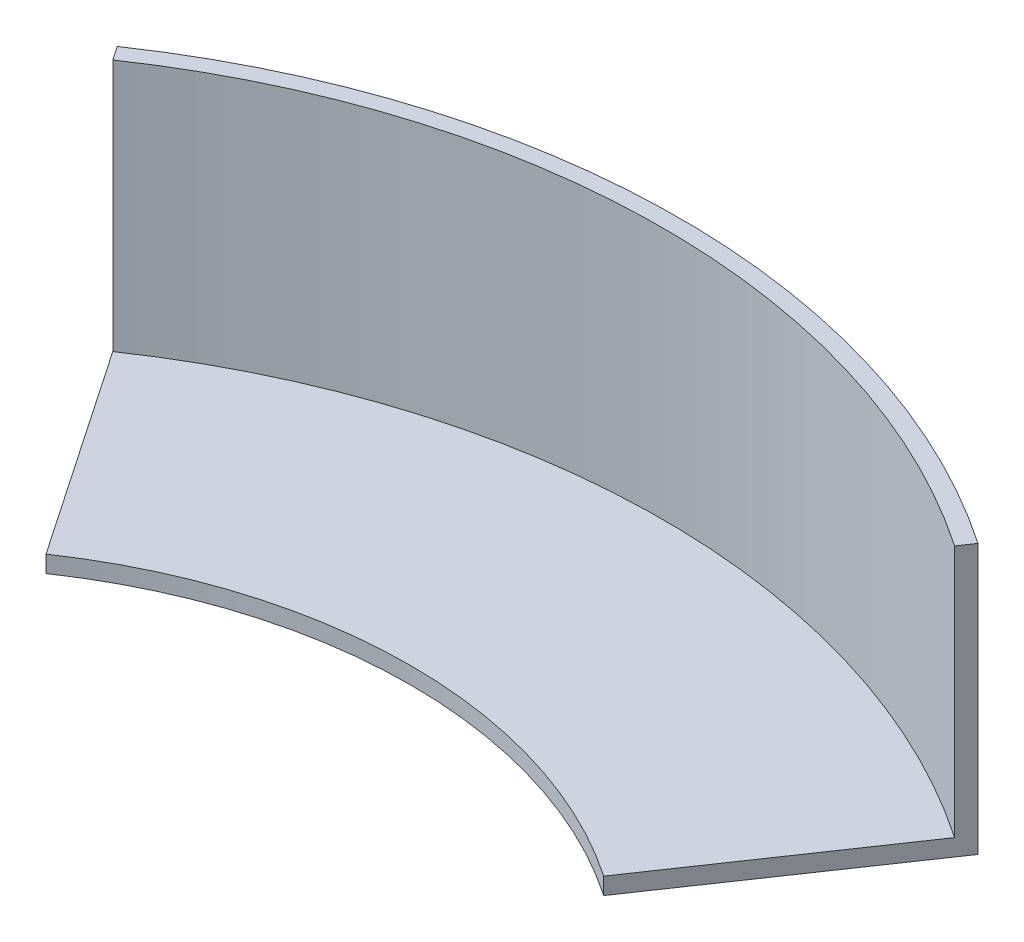
ISO-10303-21;
HEADER;
FILE_DESCRIPTION(('STEP AP214'),'2;1');
FILE_NAME('part.step','',(''),(''),'','','');
FILE_SCHEMA(('AUTOMOTIVE_DESIGN { 1 0 10303 214 1 1 1 1 }'));
ENDSEC;
DATA;
#1=APPLICATION_CONTEXT('core data for automotive mechanical design processes');
#2=APPLICATION_PROTOCOL_DEFINITION('international standard','automotive_design',2000,#1);
#3=PRODUCT_CONTEXT('',#1,'mechanical');
#4=PRODUCT('Part','Part','',(#3));
#5=PRODUCT_RELATED_PRODUCT_CATEGORY('part','',(#4));
#6=PRODUCT_DEFINITION_FORMATION('','',#4);
#7=PRODUCT_DEFINITION_CONTEXT('part definition',#1,'design');
#8=PRODUCT_DEFINITION('design','',#6,#7);
#9=PRODUCT_DEFINITION_SHAPE('','',#8);
#10=(LENGTH_UNIT() NAMED_UNIT(*) SI_UNIT(.MILLI.,.METRE.));
#11=(NAMED_UNIT(*) PLANE_ANGLE_UNIT() SI_UNIT($,.RADIAN.));
#12=(NAMED_UNIT(*) SI_UNIT($,.STERADIAN.) SOLID_ANGLE_UNIT());
#13=UNCERTAINTY_MEASURE_WITH_UNIT(LENGTH_MEASURE(1.E-05),#10,'distance_accuracy_value','');
#14=(GEOMETRIC_REPRESENTATION_CONTEXT(3) GLOBAL_UNCERTAINTY_ASSIGNED_CONTEXT((#13)) GLOBAL_UNIT_ASSIGNED_CONTEXT((#10,
#11,#12)) REPRESENTATION_CONTEXT('',''));
#15=CARTESIAN_POINT('',(0.,0.,0.));
#16=DIRECTION('',(0.,0.,1.));
#17=DIRECTION('',(1.,0.,0.));
#18=AXIS2_PLACEMENT_3D('',#15,#16,#17);
#19=CARTESIAN_POINT('',(0.,15.,0.));
#20=DIRECTION('',(0.,-1.,0.));
#21=DIRECTION('',(0.,0.,-1.));
#22=AXIS2_PLACEMENT_3D('',#19,#20,#21);
#23=CYLINDRICAL_SURFACE('',#22,29.45);
#24=DIRECTION('',(0.,-1.,0.));
#25=VECTOR('',#24,1.);
#26=CARTESIAN_POINT('',(16.5635545556805,15.,-24.3505885037918));
#27=LINE('',#26,#25);
#28=CARTESIAN_POINT('',(16.5635545556805,0.,-24.3505885037918));
#29=VERTEX_POINT('',#28);
#30=CARTESIAN_POINT('',(16.5635545556805,-1.,-24.3505885037918));
#31=VERTEX_POINT('',#30);
#32=EDGE_CURVE('E11',#29,#31,#27,.T.);
#33=ORIENTED_EDGE('',*,*,#32,.F.);
#34=CARTESIAN_POINT('',(0.,0.,0.));
#35=DIRECTION('',(0.,1.,0.));
#36=DIRECTION('',(0.,0.,1.));
#37=AXIS2_PLACEMENT_3D('',#34,#35,#36);
#38=CIRCLE('',#37,29.45);
#39=CARTESIAN_POINT('',(-16.5635545556805,0.,-24.3505885037918));
#40=VERTEX_POINT('',#39);
#41=EDGE_CURVE('E135',#29,#40,#38,.T.);
#42=ORIENTED_EDGE('',*,*,#41,.T.);
#43=DIRECTION('',(0.,-1.,0.));
#44=VECTOR('',#43,1.);
#45=CARTESIAN_POINT('',(-16.5635545556805,15.,-24.3505885037918));
#46=LINE('',#45,#44);
#47=CARTESIAN_POINT('',(-16.5635545556805,-1.,-24.3505885037918));
#48=VERTEX_POINT('',#47);
#49=EDGE_CURVE('E104',#40,#48,#46,.T.);
#50=ORIENTED_EDGE('',*,*,#49,.T.);
#51=CARTESIAN_POINT('',(0.,-1.,0.));
#52=DIRECTION('',(0.,1.,0.));
#53=DIRECTION('',(0.,0.,1.));
#54=AXIS2_PLACEMENT_3D('',#51,#52,#53);
#55=CIRCLE('',#54,29.45);
#56=EDGE_CURVE('E119',#31,#48,#55,.T.);
#57=ORIENTED_EDGE('',*,*,#56,.F.);
#58=EDGE_LOOP('',(#33,#42,#50,#57));
#59=FACE_BOUND('',#58,.T.);
#60=ADVANCED_FACE('F35',(#59),#23,.F.);
#61=CARTESIAN_POINT('',(0.,15.,0.));
#62=DIRECTION('',(-0.826845110485288,0.,-0.562429696287964));
#63=DIRECTION('',(-0.562429696287964,0.,0.826845110485289));
#64=AXIS2_PLACEMENT_3D('',#61,#62,#63);
#65=PLANE('',#64);
#66=DIRECTION('',(0.562429696287964,0.,-0.826845110485288));
#67=VECTOR('',#66,1.);
#68=CARTESIAN_POINT('',(0.,0.,0.));
#69=LINE('',#68,#67);
#70=CARTESIAN_POINT('',(25.,0.,-36.7532651610711));
#71=VERTEX_POINT('',#70);
#72=EDGE_CURVE('E138',#29,#71,#69,.T.);
#73=ORIENTED_EDGE('',*,*,#72,.F.);
#74=ORIENTED_EDGE('',*,*,#32,.T.);
#75=DIRECTION('',(0.562429696287964,0.,-0.826845110485289));
#76=VECTOR('',#75,1.);
#77=CARTESIAN_POINT('',(0.,-1.,0.));
#78=LINE('',#77,#76);
#79=CARTESIAN_POINT('',(25.562429696288,-1.,-37.5801102715564));
#80=VERTEX_POINT('',#79);
#81=EDGE_CURVE('E115',#31,#80,#78,.T.);
#82=ORIENTED_EDGE('',*,*,#81,.T.);
#83=DIRECTION('',(0.,-1.,0.));
#84=VECTOR('',#83,1.);
#85=CARTESIAN_POINT('',(25.562429696288,15.,-37.5801102715564));
#86=LINE('',#85,#84);
#87=CARTESIAN_POINT('',(25.562429696288,15.,-37.5801102715564));
#88=VERTEX_POINT('',#87);
#89=EDGE_CURVE('E44',#88,#80,#86,.T.);
#90=ORIENTED_EDGE('',*,*,#89,.F.);
#91=DIRECTION('',(0.562429696287964,0.,-0.826845110485288));
#92=VECTOR('',#91,1.);
#93=CARTESIAN_POINT('',(0.,15.,0.));
#94=LINE('',#93,#92);
#95=CARTESIAN_POINT('',(25.,15.,-36.7532651610711));
#96=VERTEX_POINT('',#95);
#97=EDGE_CURVE('E108',#96,#88,#94,.T.);
#98=ORIENTED_EDGE('',*,*,#97,.F.);
#99=DIRECTION('',(0.,-1.,0.));
#100=VECTOR('',#99,1.);
#101=CARTESIAN_POINT('',(25.,15.,-36.7532651610711));
#102=LINE('',#101,#100);
#103=EDGE_CURVE('E52',#96,#71,#102,.T.);
#104=ORIENTED_EDGE('',*,*,#103,.T.);
#105=EDGE_LOOP('',(#73,#74,#82,#90,#98,#104));
#106=FACE_BOUND('',#105,.T.);
#107=ADVANCED_FACE('F144',(#106),#65,.F.);
#108=CARTESIAN_POINT('',(0.,15.,0.));
#109=DIRECTION('',(0.826845110485288,0.,-0.562429696287964));
#110=DIRECTION('',(-0.562429696287964,0.,-0.826845110485288));
#111=AXIS2_PLACEMENT_3D('',#108,#109,#110);
#112=PLANE('',#111);
#113=DIRECTION('',(0.562429696287964,0.,0.826845110485288));
#114=VECTOR('',#113,1.);
#115=CARTESIAN_POINT('',(0.,0.,0.));
#116=LINE('',#115,#114);
#117=CARTESIAN_POINT('',(-25.,0.,-36.7532651610711));
#118=VERTEX_POINT('',#117);
#119=EDGE_CURVE('E94',#118,#40,#116,.T.);
#120=ORIENTED_EDGE('',*,*,#119,.F.);
#121=DIRECTION('',(0.,-1.,0.));
#122=VECTOR('',#121,1.);
#123=CARTESIAN_POINT('',(-25.,15.,-36.7532651610711));
#124=LINE('',#123,#122);
#125=CARTESIAN_POINT('',(-25.,15.,-36.7532651610711));
#126=VERTEX_POINT('',#125);
#127=EDGE_CURVE('E91',#126,#118,#124,.T.);
#128=ORIENTED_EDGE('',*,*,#127,.F.);
#129=DIRECTION('',(0.562429696287964,0.,0.826845110485288));
#130=VECTOR('',#129,1.);
#131=CARTESIAN_POINT('',(0.,15.,0.));
#132=LINE('',#131,#130);
#133=CARTESIAN_POINT('',(-25.562429696288,15.,-37.5801102715564));
#134=VERTEX_POINT('',#133);
#135=EDGE_CURVE('E100',#134,#126,#132,.T.);
#136=ORIENTED_EDGE('',*,*,#135,.F.);
#137=DIRECTION('',(0.,-1.,0.));
#138=VECTOR('',#137,1.);
#139=CARTESIAN_POINT('',(-25.562429696288,15.,-37.5801102715564));
#140=LINE('',#139,#138);
#141=CARTESIAN_POINT('',(-25.562429696288,-1.,-37.5801102715564));
#142=VERTEX_POINT('',#141);
#143=EDGE_CURVE('E106',#134,#142,#140,.T.);
#144=ORIENTED_EDGE('',*,*,#143,.T.);
#145=DIRECTION('',(0.562429696287964,0.,0.826845110485288));
#146=VECTOR('',#145,1.);
#147=CARTESIAN_POINT('',(0.,-1.,0.));
#148=LINE('',#147,#146);
#149=EDGE_CURVE('E114',#142,#48,#148,.T.);
#150=ORIENTED_EDGE('',*,*,#149,.T.);
#151=ORIENTED_EDGE('',*,*,#49,.F.);
#152=EDGE_LOOP('',(#120,#128,#136,#144,#150,#151));
#153=FACE_BOUND('',#152,.T.);
#154=ADVANCED_FACE('F98',(#153),#112,.F.);
#155=CARTESIAN_POINT('',(0.,15.,0.));
#156=DIRECTION('',(0.,-1.,0.));
#157=DIRECTION('',(0.,0.,-1.));
#158=AXIS2_PLACEMENT_3D('',#155,#156,#157);
#159=CYLINDRICAL_SURFACE('',#158,45.45);
#160=CARTESIAN_POINT('',(0.,-1.,0.));
#161=DIRECTION('',(0.,1.,0.));
#162=DIRECTION('',(0.,0.,1.));
#163=AXIS2_PLACEMENT_3D('',#160,#161,#162);
#164=CIRCLE('',#163,45.45);
#165=EDGE_CURVE('E112',#80,#142,#164,.T.);
#166=ORIENTED_EDGE('',*,*,#165,.T.);
#167=ORIENTED_EDGE('',*,*,#143,.F.);
#168=CARTESIAN_POINT('',(0.,15.,0.));
#169=DIRECTION('',(0.,1.,0.));
#170=DIRECTION('',(0.,0.,1.));
#171=AXIS2_PLACEMENT_3D('',#168,#169,#170);
#172=CIRCLE('',#171,45.45);
#173=EDGE_CURVE('E39',#88,#134,#172,.T.);
#174=ORIENTED_EDGE('',*,*,#173,.F.);
#175=ORIENTED_EDGE('',*,*,#89,.T.);
#176=EDGE_LOOP('',(#166,#167,#174,#175));
#177=FACE_BOUND('',#176,.T.);
#178=ADVANCED_FACE('F126',(#177),#159,.T.);
#179=CARTESIAN_POINT('',(0.,15.,0.));
#180=DIRECTION('',(0.,1.,0.));
#181=DIRECTION('',(0.,0.,1.));
#182=AXIS2_PLACEMENT_3D('',#179,#180,#181);
#183=PLANE('',#182);
#184=CARTESIAN_POINT('',(0.,15.,0.));
#185=DIRECTION('',(0.,1.,0.));
#186=DIRECTION('',(0.,0.,1.));
#187=AXIS2_PLACEMENT_3D('',#184,#185,#186);
#188=CIRCLE('',#187,44.45);
#189=EDGE_CURVE('E88',#96,#126,#188,.T.);
#190=ORIENTED_EDGE('',*,*,#189,.F.);
#191=ORIENTED_EDGE('',*,*,#97,.T.);
#192=ORIENTED_EDGE('',*,*,#173,.T.);
#193=ORIENTED_EDGE('',*,*,#135,.T.);
#194=EDGE_LOOP('',(#190,#191,#192,#193));
#195=FACE_BOUND('',#194,.T.);
#196=ADVANCED_FACE('F103',(#195),#183,.T.);
#197=CARTESIAN_POINT('',(0.,-1.,0.));
#198=DIRECTION('',(0.,1.,0.));
#199=DIRECTION('',(0.,0.,1.));
#200=AXIS2_PLACEMENT_3D('',#197,#198,#199);
#201=PLANE('',#200);
#202=ORIENTED_EDGE('',*,*,#56,.T.);
#203=ORIENTED_EDGE('',*,*,#149,.F.);
#204=ORIENTED_EDGE('',*,*,#165,.F.);
#205=ORIENTED_EDGE('',*,*,#81,.F.);
#206=EDGE_LOOP('',(#202,#203,#204,#205));
#207=FACE_BOUND('',#206,.T.);
#208=ADVANCED_FACE('F37',(#207),#201,.F.);
#209=CARTESIAN_POINT('',(0.,15.,0.));
#210=DIRECTION('',(0.,-1.,0.));
#211=DIRECTION('',(0.,0.,-1.));
#212=AXIS2_PLACEMENT_3D('',#209,#210,#211);
#213=CYLINDRICAL_SURFACE('',#212,44.45);
#214=CARTESIAN_POINT('',(0.,0.,0.));
#215=DIRECTION('',(0.,1.,0.));
#216=DIRECTION('',(0.,0.,1.));
#217=AXIS2_PLACEMENT_3D('',#214,#215,#216);
#218=CIRCLE('',#217,44.45);
#219=EDGE_CURVE('E140',#71,#118,#218,.T.);
#220=ORIENTED_EDGE('',*,*,#219,.F.);
#221=ORIENTED_EDGE('',*,*,#103,.F.);
#222=ORIENTED_EDGE('',*,*,#189,.T.);
#223=ORIENTED_EDGE('',*,*,#127,.T.);
#224=EDGE_LOOP('',(#220,#221,#222,#223));
#225=FACE_BOUND('',#224,.T.);
#226=ADVANCED_FACE('F90',(#225),#213,.F.);
#227=CARTESIAN_POINT('',(0.,0.,0.));
#228=DIRECTION('',(0.,1.,0.));
#229=DIRECTION('',(0.,0.,1.));
#230=AXIS2_PLACEMENT_3D('',#227,#228,#229);
#231=PLANE('',#230);
#232=ORIENTED_EDGE('',*,*,#41,.F.);
#233=ORIENTED_EDGE('',*,*,#72,.T.);
#234=ORIENTED_EDGE('',*,*,#219,.T.);
#235=ORIENTED_EDGE('',*,*,#119,.T.);
#236=EDGE_LOOP('',(#232,#233,#234,#235));
#237=FACE_BOUND('',#236,.T.);
#238=ADVANCED_FACE('F145',(#237),#231,.T.);
#239=CLOSED_SHELL('',(#60,#107,#154,#178,#196,#208,#226,#238));
#240=MANIFOLD_SOLID_BREP('B2',#239);
#241=ADVANCED_BREP_SHAPE_REPRESENTATION('',(#18,#240),#14);
#242=SHAPE_DEFINITION_REPRESENTATION(#9,#241);
ENDSEC;
END-ISO-10303-21;
